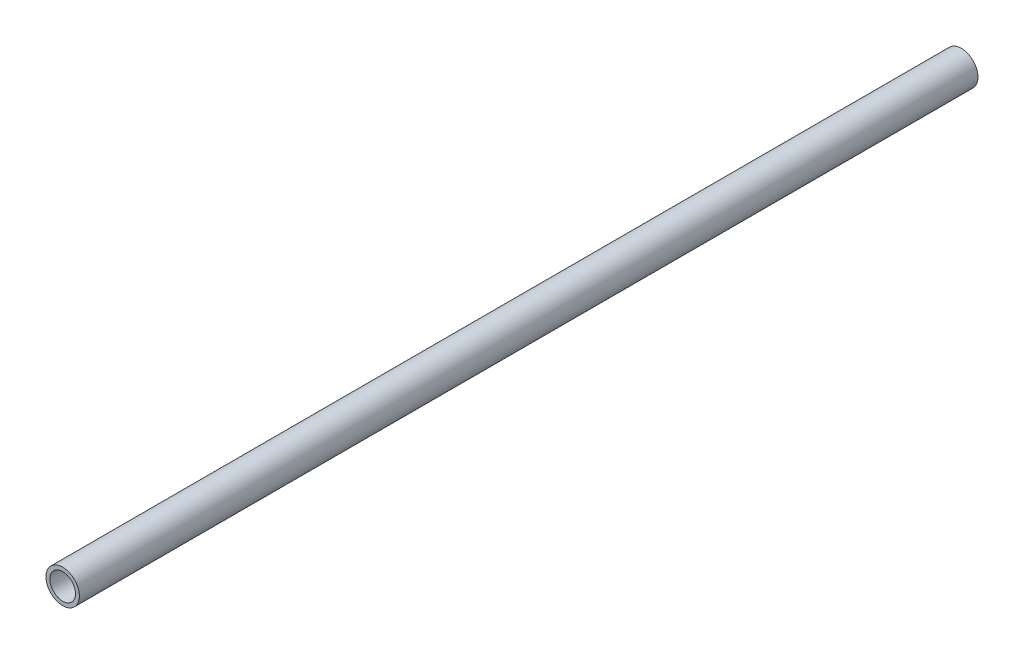
ISO-10303-21;
HEADER;
FILE_DESCRIPTION(('STEP AP214'),'2;1');
FILE_NAME('part.step','',(''),(''),'','','');
FILE_SCHEMA(('AUTOMOTIVE_DESIGN { 1 0 10303 214 1 1 1 1 }'));
ENDSEC;
DATA;
#1=APPLICATION_CONTEXT('core data for automotive mechanical design processes');
#2=APPLICATION_PROTOCOL_DEFINITION('international standard','automotive_design',2000,#1);
#3=PRODUCT_CONTEXT('',#1,'mechanical');
#4=PRODUCT('Part','Part','',(#3));
#5=PRODUCT_RELATED_PRODUCT_CATEGORY('part','',(#4));
#6=PRODUCT_DEFINITION_FORMATION('','',#4);
#7=PRODUCT_DEFINITION_CONTEXT('part definition',#1,'design');
#8=PRODUCT_DEFINITION('design','',#6,#7);
#9=PRODUCT_DEFINITION_SHAPE('','',#8);
#10=(LENGTH_UNIT() NAMED_UNIT(*) SI_UNIT(.MILLI.,.METRE.));
#11=(NAMED_UNIT(*) PLANE_ANGLE_UNIT() SI_UNIT($,.RADIAN.));
#12=(NAMED_UNIT(*) SI_UNIT($,.STERADIAN.) SOLID_ANGLE_UNIT());
#13=UNCERTAINTY_MEASURE_WITH_UNIT(LENGTH_MEASURE(1.E-05),#10,'distance_accuracy_value','');
#14=(GEOMETRIC_REPRESENTATION_CONTEXT(3) GLOBAL_UNCERTAINTY_ASSIGNED_CONTEXT((#13)) GLOBAL_UNIT_ASSIGNED_CONTEXT((#10,
#11,#12)) REPRESENTATION_CONTEXT('',''));
#15=CARTESIAN_POINT('',(0.,0.,0.));
#16=DIRECTION('',(0.,0.,1.));
#17=DIRECTION('',(1.,0.,0.));
#18=AXIS2_PLACEMENT_3D('',#15,#16,#17);
#19=CARTESIAN_POINT('',(0.,0.,175.));
#20=DIRECTION('',(0.,0.,1.));
#21=DIRECTION('',(1.,0.,0.));
#22=AXIS2_PLACEMENT_3D('',#19,#20,#21);
#23=PLANE('',#22);
#24=CARTESIAN_POINT('',(0.,0.,175.));
#25=DIRECTION('',(0.,0.,1.));
#26=DIRECTION('',(1.,0.,0.));
#27=AXIS2_PLACEMENT_3D('',#24,#25,#26);
#28=CIRCLE('',#27,6.5);
#29=CARTESIAN_POINT('',(6.5,0.,175.));
#30=VERTEX_POINT('',#29);
#31=EDGE_CURVE('E10',#30,#30,#28,.T.);
#32=ORIENTED_EDGE('',*,*,#31,.T.);
#33=EDGE_LOOP('',(#32));
#34=FACE_BOUND('',#33,.T.);
#35=CARTESIAN_POINT('',(0.,0.,175.));
#36=DIRECTION('',(0.,0.,1.));
#37=DIRECTION('',(1.,0.,0.));
#38=AXIS2_PLACEMENT_3D('',#35,#36,#37);
#39=CIRCLE('',#38,5.);
#40=CARTESIAN_POINT('',(5.,0.,175.));
#41=VERTEX_POINT('',#40);
#42=EDGE_CURVE('E50',#41,#41,#39,.T.);
#43=ORIENTED_EDGE('',*,*,#42,.F.);
#44=EDGE_LOOP('',(#43));
#45=FACE_BOUND('',#44,.T.);
#46=ADVANCED_FACE('F37',(#34,#45),#23,.T.);
#47=CARTESIAN_POINT('',(0.,0.,-175.));
#48=DIRECTION('',(0.,0.,1.));
#49=DIRECTION('',(1.,0.,0.));
#50=AXIS2_PLACEMENT_3D('',#47,#48,#49);
#51=PLANE('',#50);
#52=CARTESIAN_POINT('',(0.,0.,-175.));
#53=DIRECTION('',(0.,0.,1.));
#54=DIRECTION('',(1.,0.,0.));
#55=AXIS2_PLACEMENT_3D('',#52,#53,#54);
#56=CIRCLE('',#55,6.5);
#57=CARTESIAN_POINT('',(6.5,0.,-175.));
#58=VERTEX_POINT('',#57);
#59=EDGE_CURVE('E41',#58,#58,#56,.T.);
#60=ORIENTED_EDGE('',*,*,#59,.F.);
#61=EDGE_LOOP('',(#60));
#62=FACE_BOUND('',#61,.T.);
#63=CARTESIAN_POINT('',(0.,0.,-175.));
#64=DIRECTION('',(0.,0.,1.));
#65=DIRECTION('',(1.,0.,0.));
#66=AXIS2_PLACEMENT_3D('',#63,#64,#65);
#67=CIRCLE('',#66,5.);
#68=CARTESIAN_POINT('',(5.,0.,-175.));
#69=VERTEX_POINT('',#68);
#70=EDGE_CURVE('E52',#69,#69,#67,.T.);
#71=ORIENTED_EDGE('',*,*,#70,.T.);
#72=EDGE_LOOP('',(#71));
#73=FACE_BOUND('',#72,.T.);
#74=ADVANCED_FACE('F64',(#62,#73),#51,.F.);
#75=CARTESIAN_POINT('',(0.,0.,175.));
#76=DIRECTION('',(0.,0.,-1.));
#77=DIRECTION('',(-1.,0.,0.));
#78=AXIS2_PLACEMENT_3D('',#75,#76,#77);
#79=CYLINDRICAL_SURFACE('',#78,6.5);
#80=ORIENTED_EDGE('',*,*,#31,.F.);
#81=EDGE_LOOP('',(#80));
#82=FACE_BOUND('',#81,.T.);
#83=ORIENTED_EDGE('',*,*,#59,.T.);
#84=EDGE_LOOP('',(#83));
#85=FACE_BOUND('',#84,.T.);
#86=ADVANCED_FACE('F39',(#82,#85),#79,.T.);
#87=CARTESIAN_POINT('',(0.,0.,175.));
#88=DIRECTION('',(0.,0.,-1.));
#89=DIRECTION('',(-1.,0.,0.));
#90=AXIS2_PLACEMENT_3D('',#87,#88,#89);
#91=CYLINDRICAL_SURFACE('',#90,5.);
#92=ORIENTED_EDGE('',*,*,#42,.T.);
#93=EDGE_LOOP('',(#92));
#94=FACE_BOUND('',#93,.T.);
#95=ORIENTED_EDGE('',*,*,#70,.F.);
#96=EDGE_LOOP('',(#95));
#97=FACE_BOUND('',#96,.T.);
#98=ADVANCED_FACE('F60',(#94,#97),#91,.F.);
#99=CLOSED_SHELL('',(#46,#74,#86,#98));
#100=MANIFOLD_SOLID_BREP('B2',#99);
#101=ADVANCED_BREP_SHAPE_REPRESENTATION('',(#18,#100),#14);
#102=SHAPE_DEFINITION_REPRESENTATION(#9,#101);
ENDSEC;
END-ISO-10303-21;
